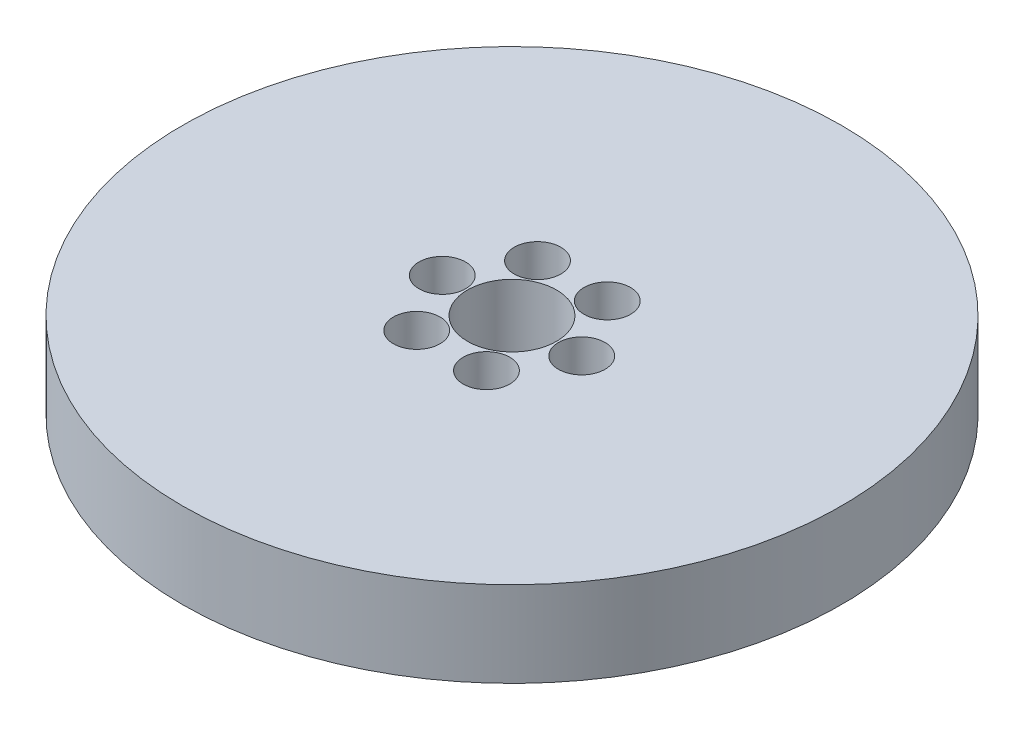
ISO-10303-21;
HEADER;
FILE_DESCRIPTION(('STEP AP214'),'2;1');
FILE_NAME('part.step','',(''),(''),'','','');
FILE_SCHEMA(('AUTOMOTIVE_DESIGN { 1 0 10303 214 1 1 1 1 }'));
ENDSEC;
DATA;
#1=APPLICATION_CONTEXT('core data for automotive mechanical design processes');
#2=APPLICATION_PROTOCOL_DEFINITION('international standard','automotive_design',2000,#1);
#3=PRODUCT_CONTEXT('',#1,'mechanical');
#4=PRODUCT('Part','Part','',(#3));
#5=PRODUCT_RELATED_PRODUCT_CATEGORY('part','',(#4));
#6=PRODUCT_DEFINITION_FORMATION('','',#4);
#7=PRODUCT_DEFINITION_CONTEXT('part definition',#1,'design');
#8=PRODUCT_DEFINITION('design','',#6,#7);
#9=PRODUCT_DEFINITION_SHAPE('','',#8);
#10=(LENGTH_UNIT() NAMED_UNIT(*) SI_UNIT(.MILLI.,.METRE.));
#11=(NAMED_UNIT(*) PLANE_ANGLE_UNIT() SI_UNIT($,.RADIAN.));
#12=(NAMED_UNIT(*) SI_UNIT($,.STERADIAN.) SOLID_ANGLE_UNIT());
#13=UNCERTAINTY_MEASURE_WITH_UNIT(LENGTH_MEASURE(1.E-05),#10,'distance_accuracy_value','');
#14=(GEOMETRIC_REPRESENTATION_CONTEXT(3) GLOBAL_UNCERTAINTY_ASSIGNED_CONTEXT((#13)) GLOBAL_UNIT_ASSIGNED_CONTEXT((#10,
#11,#12)) REPRESENTATION_CONTEXT('',''));
#15=CARTESIAN_POINT('',(0.,0.,0.));
#16=DIRECTION('',(0.,0.,1.));
#17=DIRECTION('',(1.,0.,0.));
#18=AXIS2_PLACEMENT_3D('',#15,#16,#17);
#19=CARTESIAN_POINT('',(0.,24.,0.));
#20=DIRECTION('',(0.,-1.,0.));
#21=DIRECTION('',(0.,0.,-1.));
#22=AXIS2_PLACEMENT_3D('',#19,#20,#21);
#23=CYLINDRICAL_SURFACE('',#22,92.5);
#24=CARTESIAN_POINT('',(0.,24.,0.));
#25=DIRECTION('',(0.,1.,0.));
#26=DIRECTION('',(0.,0.,1.));
#27=AXIS2_PLACEMENT_3D('',#24,#25,#26);
#28=CIRCLE('',#27,92.5);
#29=CARTESIAN_POINT('',(0.,24.,92.5));
#30=VERTEX_POINT('',#29);
#31=EDGE_CURVE('E10',#30,#30,#28,.T.);
#32=ORIENTED_EDGE('',*,*,#31,.F.);
#33=EDGE_LOOP('',(#32));
#34=FACE_BOUND('',#33,.T.);
#35=CARTESIAN_POINT('',(0.,0.,0.));
#36=DIRECTION('',(0.,1.,0.));
#37=DIRECTION('',(0.,0.,1.));
#38=AXIS2_PLACEMENT_3D('',#35,#36,#37);
#39=CIRCLE('',#38,92.5);
#40=CARTESIAN_POINT('',(0.,0.,92.5));
#41=VERTEX_POINT('',#40);
#42=EDGE_CURVE('E37',#41,#41,#39,.T.);
#43=ORIENTED_EDGE('',*,*,#42,.T.);
#44=EDGE_LOOP('',(#43));
#45=FACE_BOUND('',#44,.T.);
#46=ADVANCED_FACE('F40',(#34,#45),#23,.T.);
#47=CARTESIAN_POINT('',(0.,24.,0.));
#48=DIRECTION('',(0.,1.,0.));
#49=DIRECTION('',(0.,0.,1.));
#50=AXIS2_PLACEMENT_3D('',#47,#48,#49);
#51=PLANE('',#50);
#52=CARTESIAN_POINT('',(-9.7882237228944,24.,-16.9537008039036));
#53=DIRECTION('',(0.,1.,0.));
#54=DIRECTION('',(-0.866025403784433,0.,0.50000000000001));
#55=AXIS2_PLACEMENT_3D('',#52,#53,#54);
#56=CIRCLE('',#55,6.53858232268062);
#57=CARTESIAN_POINT('',(-15.4508021190716,24.,-13.6844096425632));
#58=VERTEX_POINT('',#57);
#59=EDGE_CURVE('E70',#58,#58,#56,.T.);
#60=ORIENTED_EDGE('',*,*,#59,.F.);
#61=EDGE_LOOP('',(#60));
#62=FACE_BOUND('',#61,.T.);
#63=CARTESIAN_POINT('',(9.78822372289404,24.,-16.9537008039038));
#64=DIRECTION('',(0.,1.,0.));
#65=DIRECTION('',(-0.866025403784443,0.,-0.499999999999992));
#66=AXIS2_PLACEMENT_3D('',#63,#64,#65);
#67=CIRCLE('',#66,6.53858232268062);
#68=CARTESIAN_POINT('',(4.12564532671673,24.,-20.2229919652441));
#69=VERTEX_POINT('',#68);
#70=EDGE_CURVE('E71',#69,#69,#67,.T.);
#71=ORIENTED_EDGE('',*,*,#70,.F.);
#72=EDGE_LOOP('',(#71));
#73=FACE_BOUND('',#72,.T.);
#74=CARTESIAN_POINT('',(19.5764474457884,24.,0.));
#75=DIRECTION('',(0.,1.,0.));
#76=DIRECTION('',(0.,0.,-1.));
#77=AXIS2_PLACEMENT_3D('',#74,#75,#76);
#78=CIRCLE('',#77,6.53858232268062);
#79=CARTESIAN_POINT('',(19.5764474457884,24.,-6.53858232268062));
#80=VERTEX_POINT('',#79);
#81=EDGE_CURVE('E78',#80,#80,#78,.T.);
#82=ORIENTED_EDGE('',*,*,#81,.F.);
#83=EDGE_LOOP('',(#82));
#84=FACE_BOUND('',#83,.T.);
#85=CARTESIAN_POINT('',(9.78822372289428,24.,16.9537008039037));
#86=DIRECTION('',(0.,1.,0.));
#87=DIRECTION('',(0.866025403784436,0.,-0.500000000000004));
#88=AXIS2_PLACEMENT_3D('',#85,#86,#87);
#89=CIRCLE('',#88,6.53858232268062);
#90=CARTESIAN_POINT('',(15.4508021190715,24.,13.6844096425634));
#91=VERTEX_POINT('',#90);
#92=EDGE_CURVE('E84',#91,#91,#89,.T.);
#93=ORIENTED_EDGE('',*,*,#92,.F.);
#94=EDGE_LOOP('',(#93));
#95=FACE_BOUND('',#94,.T.);
#96=CARTESIAN_POINT('',(-9.78822372289416,24.,16.9537008039038));
#97=DIRECTION('',(0.,1.,0.));
#98=DIRECTION('',(0.86602540378444,0.,0.499999999999998));
#99=AXIS2_PLACEMENT_3D('',#96,#97,#98);
#100=CIRCLE('',#99,6.53858232268062);
#101=CARTESIAN_POINT('',(-4.12564532671687,24.,20.2229919652441));
#102=VERTEX_POINT('',#101);
#103=EDGE_CURVE('E61',#102,#102,#100,.T.);
#104=ORIENTED_EDGE('',*,*,#103,.F.);
#105=EDGE_LOOP('',(#104));
#106=FACE_BOUND('',#105,.T.);
#107=CARTESIAN_POINT('',(-19.5764474457884,24.,0.));
#108=DIRECTION('',(0.,1.,0.));
#109=DIRECTION('',(0.,0.,1.));
#110=AXIS2_PLACEMENT_3D('',#107,#108,#109);
#111=CIRCLE('',#110,6.53858232268062);
#112=CARTESIAN_POINT('',(-19.5764474457884,24.,6.53858232268062));
#113=VERTEX_POINT('',#112);
#114=EDGE_CURVE('E54',#113,#113,#111,.T.);
#115=ORIENTED_EDGE('',*,*,#114,.F.);
#116=EDGE_LOOP('',(#115));
#117=FACE_BOUND('',#116,.T.);
#118=CARTESIAN_POINT('',(0.,24.,0.));
#119=DIRECTION('',(0.,1.,0.));
#120=DIRECTION('',(0.,0.,1.));
#121=AXIS2_PLACEMENT_3D('',#118,#119,#120);
#122=CIRCLE('',#121,12.5);
#123=CARTESIAN_POINT('',(0.,24.,12.5));
#124=VERTEX_POINT('',#123);
#125=EDGE_CURVE('E50',#124,#124,#122,.T.);
#126=ORIENTED_EDGE('',*,*,#125,.F.);
#127=EDGE_LOOP('',(#126));
#128=FACE_BOUND('',#127,.T.);
#129=ORIENTED_EDGE('',*,*,#31,.T.);
#130=EDGE_LOOP('',(#129));
#131=FACE_BOUND('',#130,.T.);
#132=ADVANCED_FACE('F99',(#62,#73,#84,#95,#106,#117,#128,#131),#51,.T.);
#133=CARTESIAN_POINT('',(0.,0.,0.));
#134=DIRECTION('',(0.,1.,0.));
#135=DIRECTION('',(0.,0.,1.));
#136=AXIS2_PLACEMENT_3D('',#133,#134,#135);
#137=PLANE('',#136);
#138=CARTESIAN_POINT('',(0.,0.,0.));
#139=DIRECTION('',(0.,1.,0.));
#140=DIRECTION('',(0.,0.,1.));
#141=AXIS2_PLACEMENT_3D('',#138,#139,#140);
#142=CIRCLE('',#141,12.5);
#143=CARTESIAN_POINT('',(0.,0.,12.5));
#144=VERTEX_POINT('',#143);
#145=EDGE_CURVE('E47',#144,#144,#142,.T.);
#146=ORIENTED_EDGE('',*,*,#145,.T.);
#147=EDGE_LOOP('',(#146));
#148=FACE_BOUND('',#147,.T.);
#149=ORIENTED_EDGE('',*,*,#42,.F.);
#150=EDGE_LOOP('',(#149));
#151=FACE_BOUND('',#150,.T.);
#152=ADVANCED_FACE('F103',(#148,#151),#137,.F.);
#153=CARTESIAN_POINT('',(0.,24.,0.));
#154=DIRECTION('',(0.,-1.,0.));
#155=DIRECTION('',(0.,0.,-1.));
#156=AXIS2_PLACEMENT_3D('',#153,#154,#155);
#157=CYLINDRICAL_SURFACE('',#156,12.5);
#158=ORIENTED_EDGE('',*,*,#125,.T.);
#159=EDGE_LOOP('',(#158));
#160=FACE_BOUND('',#159,.T.);
#161=ORIENTED_EDGE('',*,*,#145,.F.);
#162=EDGE_LOOP('',(#161));
#163=FACE_BOUND('',#162,.T.);
#164=ADVANCED_FACE('F115',(#160,#163),#157,.F.);
#165=CARTESIAN_POINT('',(-19.5764474457884,5.59017830743387,0.));
#166=DIRECTION('',(0.,1.,0.));
#167=DIRECTION('',(0.,0.,1.));
#168=AXIS2_PLACEMENT_3D('',#165,#166,#167);
#169=CYLINDRICAL_SURFACE('',#168,6.53858232268062);
#170=CARTESIAN_POINT('',(-19.5764474457884,5.59017830743387,0.));
#171=DIRECTION('',(0.,1.,0.));
#172=DIRECTION('',(0.,0.,1.));
#173=AXIS2_PLACEMENT_3D('',#170,#171,#172);
#174=CIRCLE('',#173,6.53858232268062);
#175=CARTESIAN_POINT('',(-19.5764474457884,5.59017830743387,6.53858232268062));
#176=VERTEX_POINT('',#175);
#177=EDGE_CURVE('E55',#176,#176,#174,.T.);
#178=ORIENTED_EDGE('',*,*,#177,.F.);
#179=EDGE_LOOP('',(#178));
#180=FACE_BOUND('',#179,.T.);
#181=ORIENTED_EDGE('',*,*,#114,.T.);
#182=EDGE_LOOP('',(#181));
#183=FACE_BOUND('',#182,.T.);
#184=ADVANCED_FACE('F113',(#180,#183),#169,.F.);
#185=CARTESIAN_POINT('',(-19.5764474457884,5.59017830743387,0.));
#186=DIRECTION('',(0.,1.,0.));
#187=DIRECTION('',(0.,0.,1.));
#188=AXIS2_PLACEMENT_3D('',#185,#186,#187);
#189=PLANE('',#188);
#190=ORIENTED_EDGE('',*,*,#177,.T.);
#191=EDGE_LOOP('',(#190));
#192=FACE_BOUND('',#191,.T.);
#193=ADVANCED_FACE('F144',(#192),#189,.T.);
#194=CARTESIAN_POINT('',(-9.78822372289416,5.59017830743387,16.9537008039038));
#195=DIRECTION('',(0.,1.,0.));
#196=DIRECTION('',(0.,0.,1.));
#197=AXIS2_PLACEMENT_3D('',#194,#195,#196);
#198=CYLINDRICAL_SURFACE('',#197,6.53858232268062);
#199=CARTESIAN_POINT('',(-9.78822372289416,5.59017830743387,16.9537008039038));
#200=DIRECTION('',(0.,1.,0.));
#201=DIRECTION('',(0.86602540378444,0.,0.499999999999998));
#202=AXIS2_PLACEMENT_3D('',#199,#200,#201);
#203=CIRCLE('',#202,6.53858232268062);
#204=CARTESIAN_POINT('',(-4.12564532671687,5.59017830743387,20.2229919652441));
#205=VERTEX_POINT('',#204);
#206=EDGE_CURVE('E59',#205,#205,#203,.T.);
#207=ORIENTED_EDGE('',*,*,#206,.F.);
#208=EDGE_LOOP('',(#207));
#209=FACE_BOUND('',#208,.T.);
#210=ORIENTED_EDGE('',*,*,#103,.T.);
#211=EDGE_LOOP('',(#210));
#212=FACE_BOUND('',#211,.T.);
#213=ADVANCED_FACE('F153',(#209,#212),#198,.F.);
#214=CARTESIAN_POINT('',(-9.78822372289416,5.59017830743387,16.9537008039038));
#215=DIRECTION('',(0.,1.,0.));
#216=DIRECTION('',(0.86602540378444,0.,0.499999999999998));
#217=AXIS2_PLACEMENT_3D('',#214,#215,#216);
#218=PLANE('',#217);
#219=ORIENTED_EDGE('',*,*,#206,.T.);
#220=EDGE_LOOP('',(#219));
#221=FACE_BOUND('',#220,.T.);
#222=ADVANCED_FACE('F96',(#221),#218,.T.);
#223=CARTESIAN_POINT('',(9.78822372289428,5.59017830743387,16.9537008039037));
#224=DIRECTION('',(0.,1.,0.));
#225=DIRECTION('',(0.,0.,1.));
#226=AXIS2_PLACEMENT_3D('',#223,#224,#225);
#227=CYLINDRICAL_SURFACE('',#226,6.53858232268062);
#228=CARTESIAN_POINT('',(9.78822372289428,5.59017830743387,16.9537008039037));
#229=DIRECTION('',(0.,1.,0.));
#230=DIRECTION('',(0.866025403784436,0.,-0.500000000000004));
#231=AXIS2_PLACEMENT_3D('',#228,#229,#230);
#232=CIRCLE('',#231,6.53858232268062);
#233=CARTESIAN_POINT('',(15.4508021190715,5.59017830743387,13.6844096425634));
#234=VERTEX_POINT('',#233);
#235=EDGE_CURVE('E63',#234,#234,#232,.T.);
#236=ORIENTED_EDGE('',*,*,#235,.F.);
#237=EDGE_LOOP('',(#236));
#238=FACE_BOUND('',#237,.T.);
#239=ORIENTED_EDGE('',*,*,#92,.T.);
#240=EDGE_LOOP('',(#239));
#241=FACE_BOUND('',#240,.T.);
#242=ADVANCED_FACE('F91',(#238,#241),#227,.F.);
#243=CARTESIAN_POINT('',(9.78822372289428,5.59017830743387,16.9537008039037));
#244=DIRECTION('',(0.,1.,0.));
#245=DIRECTION('',(0.866025403784436,0.,-0.500000000000004));
#246=AXIS2_PLACEMENT_3D('',#243,#244,#245);
#247=PLANE('',#246);
#248=ORIENTED_EDGE('',*,*,#235,.T.);
#249=EDGE_LOOP('',(#248));
#250=FACE_BOUND('',#249,.T.);
#251=ADVANCED_FACE('F93',(#250),#247,.T.);
#252=CARTESIAN_POINT('',(19.5764474457884,5.59017830743387,0.));
#253=DIRECTION('',(0.,1.,0.));
#254=DIRECTION('',(0.,0.,1.));
#255=AXIS2_PLACEMENT_3D('',#252,#253,#254);
#256=CYLINDRICAL_SURFACE('',#255,6.53858232268062);
#257=CARTESIAN_POINT('',(19.5764474457884,5.59017830743387,0.));
#258=DIRECTION('',(0.,1.,0.));
#259=DIRECTION('',(0.,0.,-1.));
#260=AXIS2_PLACEMENT_3D('',#257,#258,#259);
#261=CIRCLE('',#260,6.53858232268062);
#262=CARTESIAN_POINT('',(19.5764474457884,5.59017830743387,-6.53858232268062));
#263=VERTEX_POINT('',#262);
#264=EDGE_CURVE('E85',#263,#263,#261,.T.);
#265=ORIENTED_EDGE('',*,*,#264,.F.);
#266=EDGE_LOOP('',(#265));
#267=FACE_BOUND('',#266,.T.);
#268=ORIENTED_EDGE('',*,*,#81,.T.);
#269=EDGE_LOOP('',(#268));
#270=FACE_BOUND('',#269,.T.);
#271=ADVANCED_FACE('F187',(#267,#270),#256,.F.);
#272=CARTESIAN_POINT('',(19.5764474457884,5.59017830743387,0.));
#273=DIRECTION('',(0.,1.,0.));
#274=DIRECTION('',(0.,0.,-1.));
#275=AXIS2_PLACEMENT_3D('',#272,#273,#274);
#276=PLANE('',#275);
#277=ORIENTED_EDGE('',*,*,#264,.T.);
#278=EDGE_LOOP('',(#277));
#279=FACE_BOUND('',#278,.T.);
#280=ADVANCED_FACE('F198',(#279),#276,.T.);
#281=CARTESIAN_POINT('',(9.78822372289404,5.59017830743387,-16.9537008039038));
#282=DIRECTION('',(0.,1.,0.));
#283=DIRECTION('',(0.,0.,1.));
#284=AXIS2_PLACEMENT_3D('',#281,#282,#283);
#285=CYLINDRICAL_SURFACE('',#284,6.53858232268062);
#286=CARTESIAN_POINT('',(9.78822372289404,5.59017830743387,-16.9537008039038));
#287=DIRECTION('',(0.,1.,0.));
#288=DIRECTION('',(-0.866025403784443,0.,-0.499999999999992));
#289=AXIS2_PLACEMENT_3D('',#286,#287,#288);
#290=CIRCLE('',#289,6.53858232268062);
#291=CARTESIAN_POINT('',(4.12564532671673,5.59017830743387,-20.2229919652441));
#292=VERTEX_POINT('',#291);
#293=EDGE_CURVE('E76',#292,#292,#290,.T.);
#294=ORIENTED_EDGE('',*,*,#293,.F.);
#295=EDGE_LOOP('',(#294));
#296=FACE_BOUND('',#295,.T.);
#297=ORIENTED_EDGE('',*,*,#70,.T.);
#298=EDGE_LOOP('',(#297));
#299=FACE_BOUND('',#298,.T.);
#300=ADVANCED_FACE('F202',(#296,#299),#285,.F.);
#301=CARTESIAN_POINT('',(9.78822372289404,5.59017830743387,-16.9537008039038));
#302=DIRECTION('',(0.,1.,0.));
#303=DIRECTION('',(-0.866025403784443,0.,-0.499999999999992));
#304=AXIS2_PLACEMENT_3D('',#301,#302,#303);
#305=PLANE('',#304);
#306=ORIENTED_EDGE('',*,*,#293,.T.);
#307=EDGE_LOOP('',(#306));
#308=FACE_BOUND('',#307,.T.);
#309=ADVANCED_FACE('F212',(#308),#305,.T.);
#310=CARTESIAN_POINT('',(-9.7882237228944,5.59017830743387,-16.9537008039036));
#311=DIRECTION('',(0.,1.,0.));
#312=DIRECTION('',(0.,0.,1.));
#313=AXIS2_PLACEMENT_3D('',#310,#311,#312);
#314=CYLINDRICAL_SURFACE('',#313,6.53858232268062);
#315=CARTESIAN_POINT('',(-9.7882237228944,5.59017830743387,-16.9537008039036));
#316=DIRECTION('',(0.,1.,0.));
#317=DIRECTION('',(-0.866025403784433,0.,0.50000000000001));
#318=AXIS2_PLACEMENT_3D('',#315,#316,#317);
#319=CIRCLE('',#318,6.53858232268062);
#320=CARTESIAN_POINT('',(-15.4508021190716,5.59017830743387,-13.6844096425632));
#321=VERTEX_POINT('',#320);
#322=EDGE_CURVE('E69',#321,#321,#319,.T.);
#323=ORIENTED_EDGE('',*,*,#322,.F.);
#324=EDGE_LOOP('',(#323));
#325=FACE_BOUND('',#324,.T.);
#326=ORIENTED_EDGE('',*,*,#59,.T.);
#327=EDGE_LOOP('',(#326));
#328=FACE_BOUND('',#327,.T.);
#329=ADVANCED_FACE('F224',(#325,#328),#314,.F.);
#330=CARTESIAN_POINT('',(-9.7882237228944,5.59017830743387,-16.9537008039036));
#331=DIRECTION('',(0.,1.,0.));
#332=DIRECTION('',(-0.866025403784433,0.,0.50000000000001));
#333=AXIS2_PLACEMENT_3D('',#330,#331,#332);
#334=PLANE('',#333);
#335=ORIENTED_EDGE('',*,*,#322,.T.);
#336=EDGE_LOOP('',(#335));
#337=FACE_BOUND('',#336,.T.);
#338=ADVANCED_FACE('F235',(#337),#334,.T.);
#339=CLOSED_SHELL('',(#46,#132,#152,#164,#184,#193,#213,#222,#242,#251,#271,#280,#300,#309,#329,#338));
#340=MANIFOLD_SOLID_BREP('B2',#339);
#341=ADVANCED_BREP_SHAPE_REPRESENTATION('',(#18,#340),#14);
#342=SHAPE_DEFINITION_REPRESENTATION(#9,#341);
ENDSEC;
END-ISO-10303-21;
